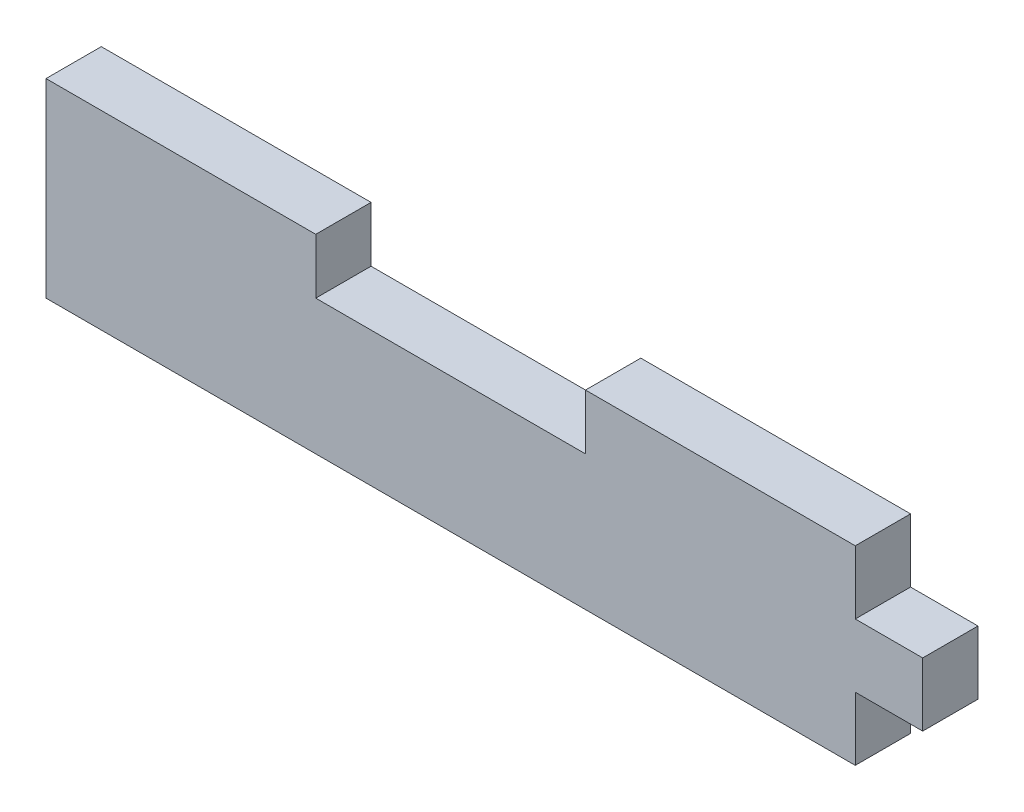
ISO-10303-21;
HEADER;
FILE_DESCRIPTION(('STEP AP214'),'2;1');
FILE_NAME('part.step','',(''),(''),'','','');
FILE_SCHEMA(('AUTOMOTIVE_DESIGN { 1 0 10303 214 1 1 1 1 }'));
ENDSEC;
DATA;
#1=APPLICATION_CONTEXT('core data for automotive mechanical design processes');
#2=APPLICATION_PROTOCOL_DEFINITION('international standard','automotive_design',2000,#1);
#3=PRODUCT_CONTEXT('',#1,'mechanical');
#4=PRODUCT('Part','Part','',(#3));
#5=PRODUCT_RELATED_PRODUCT_CATEGORY('part','',(#4));
#6=PRODUCT_DEFINITION_FORMATION('','',#4);
#7=PRODUCT_DEFINITION_CONTEXT('part definition',#1,'design');
#8=PRODUCT_DEFINITION('design','',#6,#7);
#9=PRODUCT_DEFINITION_SHAPE('','',#8);
#10=(LENGTH_UNIT() NAMED_UNIT(*) SI_UNIT(.MILLI.,.METRE.));
#11=(NAMED_UNIT(*) PLANE_ANGLE_UNIT() SI_UNIT($,.RADIAN.));
#12=(NAMED_UNIT(*) SI_UNIT($,.STERADIAN.) SOLID_ANGLE_UNIT());
#13=UNCERTAINTY_MEASURE_WITH_UNIT(LENGTH_MEASURE(1.E-05),#10,'distance_accuracy_value','');
#14=(GEOMETRIC_REPRESENTATION_CONTEXT(3) GLOBAL_UNCERTAINTY_ASSIGNED_CONTEXT((#13)) GLOBAL_UNIT_ASSIGNED_CONTEXT((#10,
#11,#12)) REPRESENTATION_CONTEXT('',''));
#15=CARTESIAN_POINT('',(0.,0.,0.));
#16=DIRECTION('',(0.,0.,1.));
#17=DIRECTION('',(1.,0.,0.));
#18=AXIS2_PLACEMENT_3D('',#15,#16,#17);
#19=CARTESIAN_POINT('',(0.,0.,5.207));
#20=DIRECTION('',(1.,0.,0.));
#21=DIRECTION('',(0.,0.,-1.));
#22=AXIS2_PLACEMENT_3D('',#19,#20,#21);
#23=PLANE('',#22);
#24=DIRECTION('',(0.,-1.,0.));
#25=VECTOR('',#24,1.);
#26=CARTESIAN_POINT('',(0.,0.,0.));
#27=LINE('',#26,#25);
#28=CARTESIAN_POINT('',(0.,17.907,0.));
#29=VERTEX_POINT('',#28);
#30=CARTESIAN_POINT('',(0.,0.,0.));
#31=VERTEX_POINT('',#30);
#32=EDGE_CURVE('E155',#29,#31,#27,.T.);
#33=ORIENTED_EDGE('',*,*,#32,.T.);
#34=DIRECTION('',(0.,0.,-1.));
#35=VECTOR('',#34,1.);
#36=CARTESIAN_POINT('',(0.,0.,5.207));
#37=LINE('',#36,#35);
#38=CARTESIAN_POINT('',(0.,0.,5.207));
#39=VERTEX_POINT('',#38);
#40=EDGE_CURVE('E11',#39,#31,#37,.T.);
#41=ORIENTED_EDGE('',*,*,#40,.F.);
#42=DIRECTION('',(0.,-1.,0.));
#43=VECTOR('',#42,1.);
#44=CARTESIAN_POINT('',(0.,0.,5.207));
#45=LINE('',#44,#43);
#46=CARTESIAN_POINT('',(0.,17.907,5.207));
#47=VERTEX_POINT('',#46);
#48=EDGE_CURVE('E177',#47,#39,#45,.T.);
#49=ORIENTED_EDGE('',*,*,#48,.F.);
#50=DIRECTION('',(0.,0.,-1.));
#51=VECTOR('',#50,1.);
#52=CARTESIAN_POINT('',(0.,17.907,5.207));
#53=LINE('',#52,#51);
#54=EDGE_CURVE('E151',#47,#29,#53,.T.);
#55=ORIENTED_EDGE('',*,*,#54,.T.);
#56=EDGE_LOOP('',(#33,#41,#49,#55));
#57=FACE_BOUND('',#56,.T.);
#58=ADVANCED_FACE('F35',(#57),#23,.F.);
#59=CARTESIAN_POINT('',(0.,0.,5.207));
#60=DIRECTION('',(0.,1.,0.));
#61=DIRECTION('',(0.,0.,1.));
#62=AXIS2_PLACEMENT_3D('',#59,#60,#61);
#63=PLANE('',#62);
#64=DIRECTION('',(1.,0.,0.));
#65=VECTOR('',#64,1.);
#66=CARTESIAN_POINT('',(0.,0.,0.));
#67=LINE('',#66,#65);
#68=CARTESIAN_POINT('',(76.2,0.,0.));
#69=VERTEX_POINT('',#68);
#70=EDGE_CURVE('E158',#31,#69,#67,.T.);
#71=ORIENTED_EDGE('',*,*,#70,.T.);
#72=DIRECTION('',(0.,0.,-1.));
#73=VECTOR('',#72,1.);
#74=CARTESIAN_POINT('',(76.2,0.,5.207));
#75=LINE('',#74,#73);
#76=CARTESIAN_POINT('',(76.2,0.,5.207));
#77=VERTEX_POINT('',#76);
#78=EDGE_CURVE('E43',#77,#69,#75,.T.);
#79=ORIENTED_EDGE('',*,*,#78,.F.);
#80=DIRECTION('',(1.,0.,0.));
#81=VECTOR('',#80,1.);
#82=CARTESIAN_POINT('',(0.,0.,5.207));
#83=LINE('',#82,#81);
#84=EDGE_CURVE('E106',#39,#77,#83,.T.);
#85=ORIENTED_EDGE('',*,*,#84,.F.);
#86=ORIENTED_EDGE('',*,*,#40,.T.);
#87=EDGE_LOOP('',(#71,#79,#85,#86));
#88=FACE_BOUND('',#87,.T.);
#89=ADVANCED_FACE('F255',(#88),#63,.F.);
#90=CARTESIAN_POINT('',(76.2,0.,5.207));
#91=DIRECTION('',(-1.,0.,0.));
#92=DIRECTION('',(0.,0.,1.));
#93=AXIS2_PLACEMENT_3D('',#90,#91,#92);
#94=PLANE('',#93);
#95=DIRECTION('',(0.,1.,0.));
#96=VECTOR('',#95,1.);
#97=CARTESIAN_POINT('',(76.2,0.,0.));
#98=LINE('',#97,#96);
#99=CARTESIAN_POINT('',(76.2,5.969,0.));
#100=VERTEX_POINT('',#99);
#101=EDGE_CURVE('E160',#69,#100,#98,.T.);
#102=ORIENTED_EDGE('',*,*,#101,.T.);
#103=DIRECTION('',(0.,0.,-1.));
#104=VECTOR('',#103,1.);
#105=CARTESIAN_POINT('',(76.2,5.969,5.207));
#106=LINE('',#105,#104);
#107=CARTESIAN_POINT('',(76.2,5.969,5.207));
#108=VERTEX_POINT('',#107);
#109=EDGE_CURVE('E196',#108,#100,#106,.T.);
#110=ORIENTED_EDGE('',*,*,#109,.F.);
#111=DIRECTION('',(0.,1.,0.));
#112=VECTOR('',#111,1.);
#113=CARTESIAN_POINT('',(76.2,0.,5.207));
#114=LINE('',#113,#112);
#115=EDGE_CURVE('E204',#77,#108,#114,.T.);
#116=ORIENTED_EDGE('',*,*,#115,.F.);
#117=ORIENTED_EDGE('',*,*,#78,.T.);
#118=EDGE_LOOP('',(#102,#110,#116,#117));
#119=FACE_BOUND('',#118,.T.);
#120=ADVANCED_FACE('F202',(#119),#94,.F.);
#121=CARTESIAN_POINT('',(76.2,5.969,5.207));
#122=DIRECTION('',(0.,1.,0.));
#123=DIRECTION('',(0.,0.,1.));
#124=AXIS2_PLACEMENT_3D('',#121,#122,#123);
#125=PLANE('',#124);
#126=DIRECTION('',(1.,0.,0.));
#127=VECTOR('',#126,1.);
#128=CARTESIAN_POINT('',(76.2,5.969,0.));
#129=LINE('',#128,#127);
#130=CARTESIAN_POINT('',(82.55,5.969,0.));
#131=VERTEX_POINT('',#130);
#132=EDGE_CURVE('E162',#100,#131,#129,.T.);
#133=ORIENTED_EDGE('',*,*,#132,.T.);
#134=DIRECTION('',(0.,0.,-1.));
#135=VECTOR('',#134,1.);
#136=CARTESIAN_POINT('',(82.55,5.969,5.207));
#137=LINE('',#136,#135);
#138=CARTESIAN_POINT('',(82.55,5.969,5.207));
#139=VERTEX_POINT('',#138);
#140=EDGE_CURVE('E193',#139,#131,#137,.T.);
#141=ORIENTED_EDGE('',*,*,#140,.F.);
#142=DIRECTION('',(1.,0.,0.));
#143=VECTOR('',#142,1.);
#144=CARTESIAN_POINT('',(76.2,5.969,5.207));
#145=LINE('',#144,#143);
#146=EDGE_CURVE('E222',#108,#139,#145,.T.);
#147=ORIENTED_EDGE('',*,*,#146,.F.);
#148=ORIENTED_EDGE('',*,*,#109,.T.);
#149=EDGE_LOOP('',(#133,#141,#147,#148));
#150=FACE_BOUND('',#149,.T.);
#151=ADVANCED_FACE('F213',(#150),#125,.F.);
#152=CARTESIAN_POINT('',(82.55,11.938,5.207));
#153=DIRECTION('',(-1.,0.,0.));
#154=DIRECTION('',(0.,0.,1.));
#155=AXIS2_PLACEMENT_3D('',#152,#153,#154);
#156=PLANE('',#155);
#157=DIRECTION('',(0.,1.,0.));
#158=VECTOR('',#157,1.);
#159=CARTESIAN_POINT('',(82.55,11.938,0.));
#160=LINE('',#159,#158);
#161=CARTESIAN_POINT('',(82.55,11.938,0.));
#162=VERTEX_POINT('',#161);
#163=EDGE_CURVE('E164',#131,#162,#160,.T.);
#164=ORIENTED_EDGE('',*,*,#163,.T.);
#165=DIRECTION('',(0.,0.,-1.));
#166=VECTOR('',#165,1.);
#167=CARTESIAN_POINT('',(82.55,11.938,5.207));
#168=LINE('',#167,#166);
#169=CARTESIAN_POINT('',(82.55,11.938,5.207));
#170=VERTEX_POINT('',#169);
#171=EDGE_CURVE('E190',#170,#162,#168,.T.);
#172=ORIENTED_EDGE('',*,*,#171,.F.);
#173=DIRECTION('',(0.,1.,0.));
#174=VECTOR('',#173,1.);
#175=CARTESIAN_POINT('',(82.55,11.938,5.207));
#176=LINE('',#175,#174);
#177=EDGE_CURVE('E219',#139,#170,#176,.T.);
#178=ORIENTED_EDGE('',*,*,#177,.F.);
#179=ORIENTED_EDGE('',*,*,#140,.T.);
#180=EDGE_LOOP('',(#164,#172,#178,#179));
#181=FACE_BOUND('',#180,.T.);
#182=ADVANCED_FACE('F217',(#181),#156,.F.);
#183=CARTESIAN_POINT('',(76.2,11.938,5.207));
#184=DIRECTION('',(0.,-1.,0.));
#185=DIRECTION('',(0.,0.,-1.));
#186=AXIS2_PLACEMENT_3D('',#183,#184,#185);
#187=PLANE('',#186);
#188=DIRECTION('',(-1.,0.,0.));
#189=VECTOR('',#188,1.);
#190=CARTESIAN_POINT('',(76.2,11.938,0.));
#191=LINE('',#190,#189);
#192=CARTESIAN_POINT('',(76.2,11.938,0.));
#193=VERTEX_POINT('',#192);
#194=EDGE_CURVE('E166',#162,#193,#191,.T.);
#195=ORIENTED_EDGE('',*,*,#194,.T.);
#196=DIRECTION('',(0.,0.,-1.));
#197=VECTOR('',#196,1.);
#198=CARTESIAN_POINT('',(76.2,11.938,5.207));
#199=LINE('',#198,#197);
#200=CARTESIAN_POINT('',(76.2,11.938,5.207));
#201=VERTEX_POINT('',#200);
#202=EDGE_CURVE('E187',#201,#193,#199,.T.);
#203=ORIENTED_EDGE('',*,*,#202,.F.);
#204=DIRECTION('',(-1.,0.,0.));
#205=VECTOR('',#204,1.);
#206=CARTESIAN_POINT('',(76.2,11.938,5.207));
#207=LINE('',#206,#205);
#208=EDGE_CURVE('E221',#170,#201,#207,.T.);
#209=ORIENTED_EDGE('',*,*,#208,.F.);
#210=ORIENTED_EDGE('',*,*,#171,.T.);
#211=EDGE_LOOP('',(#195,#203,#209,#210));
#212=FACE_BOUND('',#211,.T.);
#213=ADVANCED_FACE('F268',(#212),#187,.F.);
#214=CARTESIAN_POINT('',(76.2,11.938,5.207));
#215=DIRECTION('',(-1.,0.,0.));
#216=DIRECTION('',(0.,0.,1.));
#217=AXIS2_PLACEMENT_3D('',#214,#215,#216);
#218=PLANE('',#217);
#219=DIRECTION('',(0.,1.,0.));
#220=VECTOR('',#219,1.);
#221=CARTESIAN_POINT('',(76.2,11.938,0.));
#222=LINE('',#221,#220);
#223=CARTESIAN_POINT('',(76.2,17.907,0.));
#224=VERTEX_POINT('',#223);
#225=EDGE_CURVE('E168',#193,#224,#222,.T.);
#226=ORIENTED_EDGE('',*,*,#225,.T.);
#227=DIRECTION('',(0.,0.,-1.));
#228=VECTOR('',#227,1.);
#229=CARTESIAN_POINT('',(76.2,17.907,5.207));
#230=LINE('',#229,#228);
#231=CARTESIAN_POINT('',(76.2,17.907,5.207));
#232=VERTEX_POINT('',#231);
#233=EDGE_CURVE('E184',#232,#224,#230,.T.);
#234=ORIENTED_EDGE('',*,*,#233,.F.);
#235=DIRECTION('',(0.,1.,0.));
#236=VECTOR('',#235,1.);
#237=CARTESIAN_POINT('',(76.2,11.938,5.207));
#238=LINE('',#237,#236);
#239=EDGE_CURVE('E224',#201,#232,#238,.T.);
#240=ORIENTED_EDGE('',*,*,#239,.F.);
#241=ORIENTED_EDGE('',*,*,#202,.T.);
#242=EDGE_LOOP('',(#226,#234,#240,#241));
#243=FACE_BOUND('',#242,.T.);
#244=ADVANCED_FACE('F271',(#243),#218,.F.);
#245=CARTESIAN_POINT('',(50.8,17.907,5.207));
#246=DIRECTION('',(0.,-1.,0.));
#247=DIRECTION('',(0.,0.,-1.));
#248=AXIS2_PLACEMENT_3D('',#245,#246,#247);
#249=PLANE('',#248);
#250=DIRECTION('',(-1.,0.,0.));
#251=VECTOR('',#250,1.);
#252=CARTESIAN_POINT('',(50.8,17.907,0.));
#253=LINE('',#252,#251);
#254=CARTESIAN_POINT('',(50.8,17.907,0.));
#255=VERTEX_POINT('',#254);
#256=EDGE_CURVE('E170',#224,#255,#253,.T.);
#257=ORIENTED_EDGE('',*,*,#256,.T.);
#258=DIRECTION('',(0.,0.,-1.));
#259=VECTOR('',#258,1.);
#260=CARTESIAN_POINT('',(50.8,17.907,5.207));
#261=LINE('',#260,#259);
#262=CARTESIAN_POINT('',(50.8,17.907,5.207));
#263=VERTEX_POINT('',#262);
#264=EDGE_CURVE('E181',#263,#255,#261,.T.);
#265=ORIENTED_EDGE('',*,*,#264,.F.);
#266=DIRECTION('',(-1.,0.,0.));
#267=VECTOR('',#266,1.);
#268=CARTESIAN_POINT('',(50.8,17.907,5.207));
#269=LINE('',#268,#267);
#270=EDGE_CURVE('E230',#232,#263,#269,.T.);
#271=ORIENTED_EDGE('',*,*,#270,.F.);
#272=ORIENTED_EDGE('',*,*,#233,.T.);
#273=EDGE_LOOP('',(#257,#265,#271,#272));
#274=FACE_BOUND('',#273,.T.);
#275=ADVANCED_FACE('F236',(#274),#249,.F.);
#276=CARTESIAN_POINT('',(50.8,17.907,5.207));
#277=DIRECTION('',(1.,0.,0.));
#278=DIRECTION('',(0.,0.,-1.));
#279=AXIS2_PLACEMENT_3D('',#276,#277,#278);
#280=PLANE('',#279);
#281=DIRECTION('',(0.,-1.,0.));
#282=VECTOR('',#281,1.);
#283=CARTESIAN_POINT('',(50.8,17.907,0.));
#284=LINE('',#283,#282);
#285=CARTESIAN_POINT('',(50.8,12.7,0.));
#286=VERTEX_POINT('',#285);
#287=EDGE_CURVE('E172',#255,#286,#284,.T.);
#288=ORIENTED_EDGE('',*,*,#287,.T.);
#289=DIRECTION('',(0.,0.,-1.));
#290=VECTOR('',#289,1.);
#291=CARTESIAN_POINT('',(50.8,12.7,5.207));
#292=LINE('',#291,#290);
#293=CARTESIAN_POINT('',(50.8,12.7,5.207));
#294=VERTEX_POINT('',#293);
#295=EDGE_CURVE('E146',#294,#286,#292,.T.);
#296=ORIENTED_EDGE('',*,*,#295,.F.);
#297=DIRECTION('',(0.,-1.,0.));
#298=VECTOR('',#297,1.);
#299=CARTESIAN_POINT('',(50.8,17.907,5.207));
#300=LINE('',#299,#298);
#301=EDGE_CURVE('E137',#263,#294,#300,.T.);
#302=ORIENTED_EDGE('',*,*,#301,.F.);
#303=ORIENTED_EDGE('',*,*,#264,.T.);
#304=EDGE_LOOP('',(#288,#296,#302,#303));
#305=FACE_BOUND('',#304,.T.);
#306=ADVANCED_FACE('F240',(#305),#280,.F.);
#307=CARTESIAN_POINT('',(25.4,12.7,5.207));
#308=DIRECTION('',(0.,-1.,0.));
#309=DIRECTION('',(0.,0.,-1.));
#310=AXIS2_PLACEMENT_3D('',#307,#308,#309);
#311=PLANE('',#310);
#312=DIRECTION('',(-1.,0.,0.));
#313=VECTOR('',#312,1.);
#314=CARTESIAN_POINT('',(25.4,12.7,0.));
#315=LINE('',#314,#313);
#316=CARTESIAN_POINT('',(25.4,12.7,0.));
#317=VERTEX_POINT('',#316);
#318=EDGE_CURVE('E145',#286,#317,#315,.T.);
#319=ORIENTED_EDGE('',*,*,#318,.T.);
#320=DIRECTION('',(0.,0.,-1.));
#321=VECTOR('',#320,1.);
#322=CARTESIAN_POINT('',(25.4,12.7,5.207));
#323=LINE('',#322,#321);
#324=CARTESIAN_POINT('',(25.4,12.7,5.207));
#325=VERTEX_POINT('',#324);
#326=EDGE_CURVE('E142',#325,#317,#323,.T.);
#327=ORIENTED_EDGE('',*,*,#326,.F.);
#328=DIRECTION('',(-1.,0.,0.));
#329=VECTOR('',#328,1.);
#330=CARTESIAN_POINT('',(25.4,12.7,5.207));
#331=LINE('',#330,#329);
#332=EDGE_CURVE('E131',#294,#325,#331,.T.);
#333=ORIENTED_EDGE('',*,*,#332,.F.);
#334=ORIENTED_EDGE('',*,*,#295,.T.);
#335=EDGE_LOOP('',(#319,#327,#333,#334));
#336=FACE_BOUND('',#335,.T.);
#337=ADVANCED_FACE('F143',(#336),#311,.F.);
#338=CARTESIAN_POINT('',(25.4,17.907,5.207));
#339=DIRECTION('',(-1.,0.,0.));
#340=DIRECTION('',(0.,0.,1.));
#341=AXIS2_PLACEMENT_3D('',#338,#339,#340);
#342=PLANE('',#341);
#343=DIRECTION('',(0.,1.,0.));
#344=VECTOR('',#343,1.);
#345=CARTESIAN_POINT('',(25.4,17.907,0.));
#346=LINE('',#345,#344);
#347=CARTESIAN_POINT('',(25.4,17.907,0.));
#348=VERTEX_POINT('',#347);
#349=EDGE_CURVE('E92',#317,#348,#346,.T.);
#350=ORIENTED_EDGE('',*,*,#349,.T.);
#351=DIRECTION('',(0.,0.,-1.));
#352=VECTOR('',#351,1.);
#353=CARTESIAN_POINT('',(25.4,17.907,5.207));
#354=LINE('',#353,#352);
#355=CARTESIAN_POINT('',(25.4,17.907,5.207));
#356=VERTEX_POINT('',#355);
#357=EDGE_CURVE('E147',#356,#348,#354,.T.);
#358=ORIENTED_EDGE('',*,*,#357,.F.);
#359=DIRECTION('',(0.,1.,0.));
#360=VECTOR('',#359,1.);
#361=CARTESIAN_POINT('',(25.4,17.907,5.207));
#362=LINE('',#361,#360);
#363=EDGE_CURVE('E135',#325,#356,#362,.T.);
#364=ORIENTED_EDGE('',*,*,#363,.F.);
#365=ORIENTED_EDGE('',*,*,#326,.T.);
#366=EDGE_LOOP('',(#350,#358,#364,#365));
#367=FACE_BOUND('',#366,.T.);
#368=ADVANCED_FACE('F149',(#367),#342,.F.);
#369=CARTESIAN_POINT('',(0.,17.907,5.207));
#370=DIRECTION('',(0.,-1.,0.));
#371=DIRECTION('',(0.,0.,-1.));
#372=AXIS2_PLACEMENT_3D('',#369,#370,#371);
#373=PLANE('',#372);
#374=DIRECTION('',(-1.,0.,0.));
#375=VECTOR('',#374,1.);
#376=CARTESIAN_POINT('',(0.,17.907,0.));
#377=LINE('',#376,#375);
#378=EDGE_CURVE('E98',#348,#29,#377,.T.);
#379=ORIENTED_EDGE('',*,*,#378,.T.);
#380=ORIENTED_EDGE('',*,*,#54,.F.);
#381=DIRECTION('',(-1.,0.,0.));
#382=VECTOR('',#381,1.);
#383=CARTESIAN_POINT('',(0.,17.907,5.207));
#384=LINE('',#383,#382);
#385=EDGE_CURVE('E51',#356,#47,#384,.T.);
#386=ORIENTED_EDGE('',*,*,#385,.F.);
#387=ORIENTED_EDGE('',*,*,#357,.T.);
#388=EDGE_LOOP('',(#379,#380,#386,#387));
#389=FACE_BOUND('',#388,.T.);
#390=ADVANCED_FACE('F244',(#389),#373,.F.);
#391=CARTESIAN_POINT('',(0.,0.,5.207));
#392=DIRECTION('',(0.,0.,-1.));
#393=DIRECTION('',(-1.,0.,0.));
#394=AXIS2_PLACEMENT_3D('',#391,#392,#393);
#395=PLANE('',#394);
#396=ORIENTED_EDGE('',*,*,#48,.T.);
#397=ORIENTED_EDGE('',*,*,#84,.T.);
#398=ORIENTED_EDGE('',*,*,#115,.T.);
#399=ORIENTED_EDGE('',*,*,#146,.T.);
#400=ORIENTED_EDGE('',*,*,#177,.T.);
#401=ORIENTED_EDGE('',*,*,#208,.T.);
#402=ORIENTED_EDGE('',*,*,#239,.T.);
#403=ORIENTED_EDGE('',*,*,#270,.T.);
#404=ORIENTED_EDGE('',*,*,#301,.T.);
#405=ORIENTED_EDGE('',*,*,#332,.T.);
#406=ORIENTED_EDGE('',*,*,#363,.T.);
#407=ORIENTED_EDGE('',*,*,#385,.T.);
#408=EDGE_LOOP('',(#396,#397,#398,#399,#400,#401,#402,#403,#404,#405,#406,#407));
#409=FACE_BOUND('',#408,.T.);
#410=ADVANCED_FACE('F133',(#409),#395,.F.);
#411=CARTESIAN_POINT('',(0.,0.,0.));
#412=DIRECTION('',(0.,0.,-1.));
#413=DIRECTION('',(-1.,0.,0.));
#414=AXIS2_PLACEMENT_3D('',#411,#412,#413);
#415=PLANE('',#414);
#416=ORIENTED_EDGE('',*,*,#32,.F.);
#417=ORIENTED_EDGE('',*,*,#378,.F.);
#418=ORIENTED_EDGE('',*,*,#349,.F.);
#419=ORIENTED_EDGE('',*,*,#318,.F.);
#420=ORIENTED_EDGE('',*,*,#287,.F.);
#421=ORIENTED_EDGE('',*,*,#256,.F.);
#422=ORIENTED_EDGE('',*,*,#225,.F.);
#423=ORIENTED_EDGE('',*,*,#194,.F.);
#424=ORIENTED_EDGE('',*,*,#163,.F.);
#425=ORIENTED_EDGE('',*,*,#132,.F.);
#426=ORIENTED_EDGE('',*,*,#101,.F.);
#427=ORIENTED_EDGE('',*,*,#70,.F.);
#428=EDGE_LOOP('',(#416,#417,#418,#419,#420,#421,#422,#423,#424,#425,#426,#427));
#429=FACE_BOUND('',#428,.T.);
#430=ADVANCED_FACE('F208',(#429),#415,.T.);
#431=CLOSED_SHELL('',(#58,#89,#120,#151,#182,#213,#244,#275,#306,#337,#368,#390,#410,#430));
#432=MANIFOLD_SOLID_BREP('B2',#431);
#433=ADVANCED_BREP_SHAPE_REPRESENTATION('',(#18,#432),#14);
#434=SHAPE_DEFINITION_REPRESENTATION(#9,#433);
ENDSEC;
END-ISO-10303-21;
